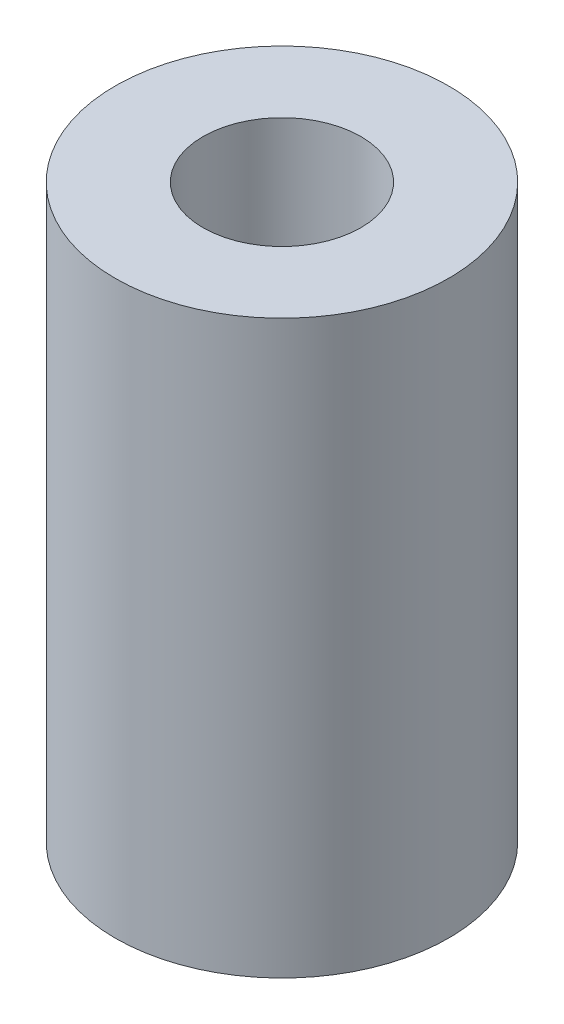
ISO-10303-21;
HEADER;
FILE_DESCRIPTION(('STEP AP214'),'2;1');
FILE_NAME('part.step','',(''),(''),'','','');
FILE_SCHEMA(('AUTOMOTIVE_DESIGN { 1 0 10303 214 1 1 1 1 }'));
ENDSEC;
DATA;
#1=APPLICATION_CONTEXT('core data for automotive mechanical design processes');
#2=APPLICATION_PROTOCOL_DEFINITION('international standard','automotive_design',2000,#1);
#3=PRODUCT_CONTEXT('',#1,'mechanical');
#4=PRODUCT('Part','Part','',(#3));
#5=PRODUCT_RELATED_PRODUCT_CATEGORY('part','',(#4));
#6=PRODUCT_DEFINITION_FORMATION('','',#4);
#7=PRODUCT_DEFINITION_CONTEXT('part definition',#1,'design');
#8=PRODUCT_DEFINITION('design','',#6,#7);
#9=PRODUCT_DEFINITION_SHAPE('','',#8);
#10=(LENGTH_UNIT() NAMED_UNIT(*) SI_UNIT(.MILLI.,.METRE.));
#11=(NAMED_UNIT(*) PLANE_ANGLE_UNIT() SI_UNIT($,.RADIAN.));
#12=(NAMED_UNIT(*) SI_UNIT($,.STERADIAN.) SOLID_ANGLE_UNIT());
#13=UNCERTAINTY_MEASURE_WITH_UNIT(LENGTH_MEASURE(1.E-05),#10,'distance_accuracy_value','');
#14=(GEOMETRIC_REPRESENTATION_CONTEXT(3) GLOBAL_UNCERTAINTY_ASSIGNED_CONTEXT((#13)) GLOBAL_UNIT_ASSIGNED_CONTEXT((#10,
#11,#12)) REPRESENTATION_CONTEXT('',''));
#15=CARTESIAN_POINT('',(0.,0.,0.));
#16=DIRECTION('',(0.,0.,1.));
#17=DIRECTION('',(1.,0.,0.));
#18=AXIS2_PLACEMENT_3D('',#15,#16,#17);
#19=CARTESIAN_POINT('',(0.,13.025,0.));
#20=DIRECTION('',(0.,1.,0.));
#21=DIRECTION('',(0.,0.,1.));
#22=AXIS2_PLACEMENT_3D('',#19,#20,#21);
#23=PLANE('',#22);
#24=CARTESIAN_POINT('',(0.,13.025,0.));
#25=DIRECTION('',(0.,1.,0.));
#26=DIRECTION('',(0.,0.,1.));
#27=AXIS2_PLACEMENT_3D('',#24,#25,#26);
#28=CIRCLE('',#27,3.8);
#29=CARTESIAN_POINT('',(0.,13.025,3.8));
#30=VERTEX_POINT('',#29);
#31=EDGE_CURVE('E10',#30,#30,#28,.T.);
#32=ORIENTED_EDGE('',*,*,#31,.T.);
#33=EDGE_LOOP('',(#32));
#34=FACE_BOUND('',#33,.T.);
#35=CARTESIAN_POINT('',(0.,13.025,0.));
#36=DIRECTION('',(0.,1.,0.));
#37=DIRECTION('',(0.,0.,1.));
#38=AXIS2_PLACEMENT_3D('',#35,#36,#37);
#39=CIRCLE('',#38,1.8);
#40=CARTESIAN_POINT('',(0.,13.025,1.8));
#41=VERTEX_POINT('',#40);
#42=EDGE_CURVE('E54',#41,#41,#39,.T.);
#43=ORIENTED_EDGE('',*,*,#42,.F.);
#44=EDGE_LOOP('',(#43));
#45=FACE_BOUND('',#44,.T.);
#46=ADVANCED_FACE('F41',(#34,#45),#23,.T.);
#47=CARTESIAN_POINT('',(0.,0.,0.));
#48=DIRECTION('',(0.,1.,0.));
#49=DIRECTION('',(0.,0.,1.));
#50=AXIS2_PLACEMENT_3D('',#47,#48,#49);
#51=PLANE('',#50);
#52=CARTESIAN_POINT('',(0.,0.,0.));
#53=DIRECTION('',(0.,1.,0.));
#54=DIRECTION('',(0.,0.,1.));
#55=AXIS2_PLACEMENT_3D('',#52,#53,#54);
#56=CIRCLE('',#55,3.8);
#57=CARTESIAN_POINT('',(0.,0.,3.8));
#58=VERTEX_POINT('',#57);
#59=EDGE_CURVE('E45',#58,#58,#56,.T.);
#60=ORIENTED_EDGE('',*,*,#59,.F.);
#61=EDGE_LOOP('',(#60));
#62=FACE_BOUND('',#61,.T.);
#63=CARTESIAN_POINT('',(0.,0.,0.));
#64=DIRECTION('',(0.,1.,0.));
#65=DIRECTION('',(0.,0.,1.));
#66=AXIS2_PLACEMENT_3D('',#63,#64,#65);
#67=CIRCLE('',#66,1.8);
#68=CARTESIAN_POINT('',(0.,0.,1.8));
#69=VERTEX_POINT('',#68);
#70=EDGE_CURVE('E56',#69,#69,#67,.T.);
#71=ORIENTED_EDGE('',*,*,#70,.T.);
#72=EDGE_LOOP('',(#71));
#73=FACE_BOUND('',#72,.T.);
#74=ADVANCED_FACE('F68',(#62,#73),#51,.F.);
#75=CARTESIAN_POINT('',(0.,13.025,0.));
#76=DIRECTION('',(0.,-1.,0.));
#77=DIRECTION('',(0.,0.,-1.));
#78=AXIS2_PLACEMENT_3D('',#75,#76,#77);
#79=CYLINDRICAL_SURFACE('',#78,3.8);
#80=ORIENTED_EDGE('',*,*,#31,.F.);
#81=EDGE_LOOP('',(#80));
#82=FACE_BOUND('',#81,.T.);
#83=ORIENTED_EDGE('',*,*,#59,.T.);
#84=EDGE_LOOP('',(#83));
#85=FACE_BOUND('',#84,.T.);
#86=ADVANCED_FACE('F43',(#82,#85),#79,.T.);
#87=CARTESIAN_POINT('',(0.,13.025,0.));
#88=DIRECTION('',(0.,-1.,0.));
#89=DIRECTION('',(0.,0.,-1.));
#90=AXIS2_PLACEMENT_3D('',#87,#88,#89);
#91=CYLINDRICAL_SURFACE('',#90,1.8);
#92=ORIENTED_EDGE('',*,*,#42,.T.);
#93=EDGE_LOOP('',(#92));
#94=FACE_BOUND('',#93,.T.);
#95=ORIENTED_EDGE('',*,*,#70,.F.);
#96=EDGE_LOOP('',(#95));
#97=FACE_BOUND('',#96,.T.);
#98=ADVANCED_FACE('F64',(#94,#97),#91,.F.);
#99=CLOSED_SHELL('',(#46,#74,#86,#98));
#100=MANIFOLD_SOLID_BREP('B2',#99);
#101=ADVANCED_BREP_SHAPE_REPRESENTATION('',(#18,#100),#14);
#102=SHAPE_DEFINITION_REPRESENTATION(#9,#101);
ENDSEC;
END-ISO-10303-21;
